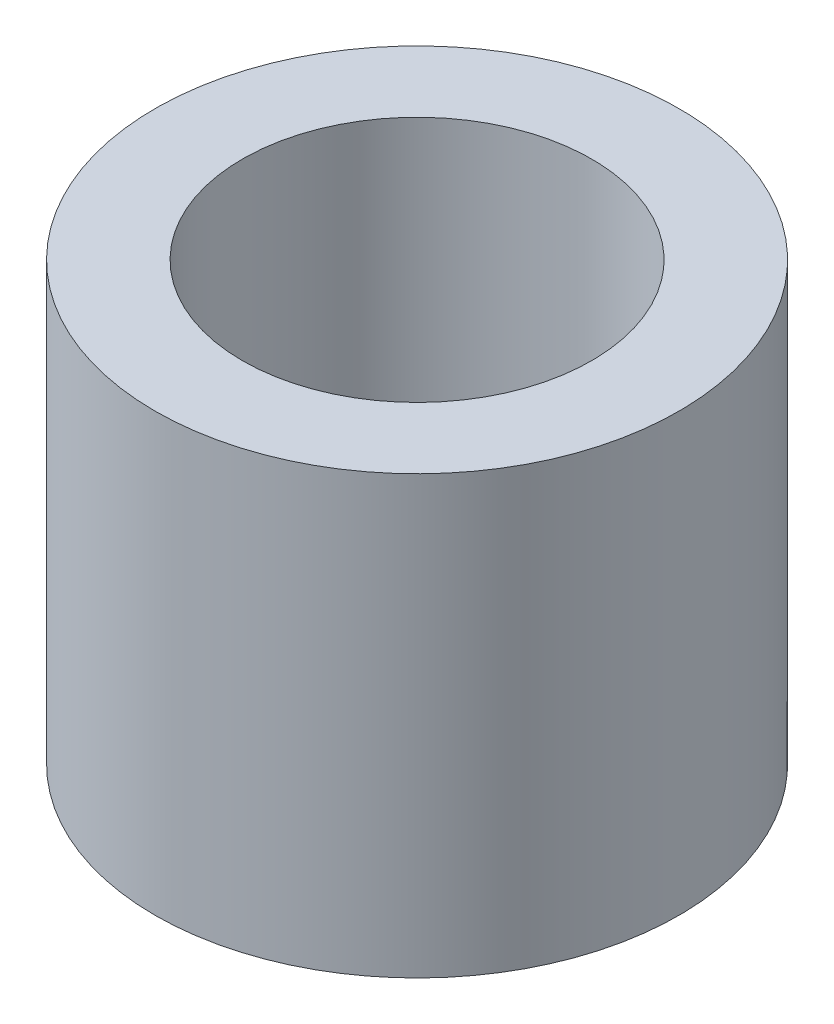
ISO-10303-21;
HEADER;
FILE_DESCRIPTION(('STEP AP214'),'2;1');
FILE_NAME('part.step','',(''),(''),'','','');
FILE_SCHEMA(('AUTOMOTIVE_DESIGN { 1 0 10303 214 1 1 1 1 }'));
ENDSEC;
DATA;
#1=APPLICATION_CONTEXT('core data for automotive mechanical design processes');
#2=APPLICATION_PROTOCOL_DEFINITION('international standard','automotive_design',2000,#1);
#3=PRODUCT_CONTEXT('',#1,'mechanical');
#4=PRODUCT('Part','Part','',(#3));
#5=PRODUCT_RELATED_PRODUCT_CATEGORY('part','',(#4));
#6=PRODUCT_DEFINITION_FORMATION('','',#4);
#7=PRODUCT_DEFINITION_CONTEXT('part definition',#1,'design');
#8=PRODUCT_DEFINITION('design','',#6,#7);
#9=PRODUCT_DEFINITION_SHAPE('','',#8);
#10=(LENGTH_UNIT() NAMED_UNIT(*) SI_UNIT(.MILLI.,.METRE.));
#11=(NAMED_UNIT(*) PLANE_ANGLE_UNIT() SI_UNIT($,.RADIAN.));
#12=(NAMED_UNIT(*) SI_UNIT($,.STERADIAN.) SOLID_ANGLE_UNIT());
#13=UNCERTAINTY_MEASURE_WITH_UNIT(LENGTH_MEASURE(1.E-05),#10,'distance_accuracy_value','');
#14=(GEOMETRIC_REPRESENTATION_CONTEXT(3) GLOBAL_UNCERTAINTY_ASSIGNED_CONTEXT((#13)) GLOBAL_UNIT_ASSIGNED_CONTEXT((#10,
#11,#12)) REPRESENTATION_CONTEXT('',''));
#15=CARTESIAN_POINT('',(0.,0.,0.));
#16=DIRECTION('',(0.,0.,1.));
#17=DIRECTION('',(1.,0.,0.));
#18=AXIS2_PLACEMENT_3D('',#15,#16,#17);
#19=CARTESIAN_POINT('',(0.,5.,-0.265782307544548));
#20=DIRECTION('',(0.,1.,0.));
#21=DIRECTION('',(0.,0.,1.));
#22=AXIS2_PLACEMENT_3D('',#19,#20,#21);
#23=PLANE('',#22);
#24=CARTESIAN_POINT('',(0.,5.,-0.265782307544548));
#25=DIRECTION('',(0.,1.,0.));
#26=DIRECTION('',(0.,0.,1.));
#27=AXIS2_PLACEMENT_3D('',#24,#25,#26);
#28=CIRCLE('',#27,3.);
#29=CARTESIAN_POINT('',(0.,5.,2.73421769245545));
#30=VERTEX_POINT('',#29);
#31=EDGE_CURVE('E10',#30,#30,#28,.T.);
#32=ORIENTED_EDGE('',*,*,#31,.T.);
#33=EDGE_LOOP('',(#32));
#34=FACE_BOUND('',#33,.T.);
#35=CARTESIAN_POINT('',(0.,5.,-0.265782307544548));
#36=DIRECTION('',(0.,1.,0.));
#37=DIRECTION('',(0.,0.,1.));
#38=AXIS2_PLACEMENT_3D('',#35,#36,#37);
#39=CIRCLE('',#38,2.);
#40=CARTESIAN_POINT('',(0.,5.,1.73421769245545));
#41=VERTEX_POINT('',#40);
#42=EDGE_CURVE('E50',#41,#41,#39,.T.);
#43=ORIENTED_EDGE('',*,*,#42,.F.);
#44=EDGE_LOOP('',(#43));
#45=FACE_BOUND('',#44,.T.);
#46=ADVANCED_FACE('F37',(#34,#45),#23,.T.);
#47=CARTESIAN_POINT('',(0.,0.,-0.265782307544548));
#48=DIRECTION('',(0.,1.,0.));
#49=DIRECTION('',(0.,0.,1.));
#50=AXIS2_PLACEMENT_3D('',#47,#48,#49);
#51=PLANE('',#50);
#52=CARTESIAN_POINT('',(0.,0.,-0.265782307544548));
#53=DIRECTION('',(0.,1.,0.));
#54=DIRECTION('',(0.,0.,1.));
#55=AXIS2_PLACEMENT_3D('',#52,#53,#54);
#56=CIRCLE('',#55,3.);
#57=CARTESIAN_POINT('',(0.,0.,2.73421769245545));
#58=VERTEX_POINT('',#57);
#59=EDGE_CURVE('E41',#58,#58,#56,.T.);
#60=ORIENTED_EDGE('',*,*,#59,.F.);
#61=EDGE_LOOP('',(#60));
#62=FACE_BOUND('',#61,.T.);
#63=CARTESIAN_POINT('',(0.,0.,-0.265782307544548));
#64=DIRECTION('',(0.,1.,0.));
#65=DIRECTION('',(0.,0.,1.));
#66=AXIS2_PLACEMENT_3D('',#63,#64,#65);
#67=CIRCLE('',#66,2.);
#68=CARTESIAN_POINT('',(0.,0.,1.73421769245545));
#69=VERTEX_POINT('',#68);
#70=EDGE_CURVE('E52',#69,#69,#67,.T.);
#71=ORIENTED_EDGE('',*,*,#70,.T.);
#72=EDGE_LOOP('',(#71));
#73=FACE_BOUND('',#72,.T.);
#74=ADVANCED_FACE('F64',(#62,#73),#51,.F.);
#75=CARTESIAN_POINT('',(0.,5.,-0.265782307544548));
#76=DIRECTION('',(0.,-1.,0.));
#77=DIRECTION('',(0.,0.,-1.));
#78=AXIS2_PLACEMENT_3D('',#75,#76,#77);
#79=CYLINDRICAL_SURFACE('',#78,3.);
#80=ORIENTED_EDGE('',*,*,#31,.F.);
#81=EDGE_LOOP('',(#80));
#82=FACE_BOUND('',#81,.T.);
#83=ORIENTED_EDGE('',*,*,#59,.T.);
#84=EDGE_LOOP('',(#83));
#85=FACE_BOUND('',#84,.T.);
#86=ADVANCED_FACE('F39',(#82,#85),#79,.T.);
#87=CARTESIAN_POINT('',(0.,5.,-0.265782307544548));
#88=DIRECTION('',(0.,-1.,0.));
#89=DIRECTION('',(0.,0.,-1.));
#90=AXIS2_PLACEMENT_3D('',#87,#88,#89);
#91=CYLINDRICAL_SURFACE('',#90,2.);
#92=ORIENTED_EDGE('',*,*,#42,.T.);
#93=EDGE_LOOP('',(#92));
#94=FACE_BOUND('',#93,.T.);
#95=ORIENTED_EDGE('',*,*,#70,.F.);
#96=EDGE_LOOP('',(#95));
#97=FACE_BOUND('',#96,.T.);
#98=ADVANCED_FACE('F60',(#94,#97),#91,.F.);
#99=CLOSED_SHELL('',(#46,#74,#86,#98));
#100=MANIFOLD_SOLID_BREP('B2',#99);
#101=ADVANCED_BREP_SHAPE_REPRESENTATION('',(#18,#100),#14);
#102=SHAPE_DEFINITION_REPRESENTATION(#9,#101);
ENDSEC;
END-ISO-10303-21;
